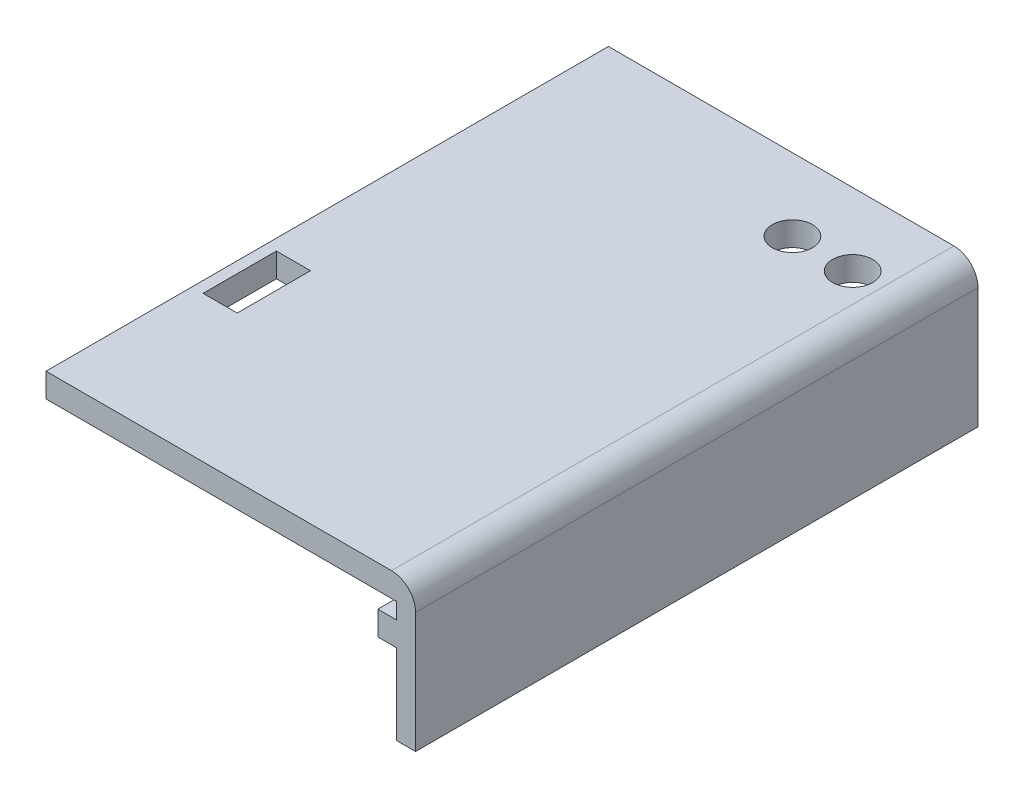
ISO-10303-21;
HEADER;
FILE_DESCRIPTION(('STEP AP214'),'2;1');
FILE_NAME('part.step','',(''),(''),'','','');
FILE_SCHEMA(('AUTOMOTIVE_DESIGN { 1 0 10303 214 1 1 1 1 }'));
ENDSEC;
DATA;
#1=APPLICATION_CONTEXT('core data for automotive mechanical design processes');
#2=APPLICATION_PROTOCOL_DEFINITION('international standard','automotive_design',2000,#1);
#3=PRODUCT_CONTEXT('',#1,'mechanical');
#4=PRODUCT('Part','Part','',(#3));
#5=PRODUCT_RELATED_PRODUCT_CATEGORY('part','',(#4));
#6=PRODUCT_DEFINITION_FORMATION('','',#4);
#7=PRODUCT_DEFINITION_CONTEXT('part definition',#1,'design');
#8=PRODUCT_DEFINITION('design','',#6,#7);
#9=PRODUCT_DEFINITION_SHAPE('','',#8);
#10=(LENGTH_UNIT() NAMED_UNIT(*) SI_UNIT(.MILLI.,.METRE.));
#11=(NAMED_UNIT(*) PLANE_ANGLE_UNIT() SI_UNIT($,.RADIAN.));
#12=(NAMED_UNIT(*) SI_UNIT($,.STERADIAN.) SOLID_ANGLE_UNIT());
#13=UNCERTAINTY_MEASURE_WITH_UNIT(LENGTH_MEASURE(1.E-05),#10,'distance_accuracy_value','');
#14=(GEOMETRIC_REPRESENTATION_CONTEXT(3) GLOBAL_UNCERTAINTY_ASSIGNED_CONTEXT((#13)) GLOBAL_UNIT_ASSIGNED_CONTEXT((#10,
#11,#12)) REPRESENTATION_CONTEXT('',''));
#15=CARTESIAN_POINT('',(0.,0.,0.));
#16=DIRECTION('',(0.,0.,1.));
#17=DIRECTION('',(1.,0.,0.));
#18=AXIS2_PLACEMENT_3D('',#15,#16,#17);
#19=CARTESIAN_POINT('',(-23.,6.,70.));
#20=DIRECTION('',(0.,1.,0.));
#21=DIRECTION('',(0.,0.,1.));
#22=AXIS2_PLACEMENT_3D('',#19,#20,#21);
#23=PLANE('',#22);
#24=DIRECTION('',(-1.,0.,0.));
#25=VECTOR('',#24,1.);
#26=CARTESIAN_POINT('',(-23.,6.,42.7111351247363));
#27=LINE('',#26,#25);
#28=CARTESIAN_POINT('',(-17.366045999883,6.,42.7111351247363));
#29=VERTEX_POINT('',#28);
#30=CARTESIAN_POINT('',(-21.6133546008317,6.,42.7111351247363));
#31=VERTEX_POINT('',#30);
#32=EDGE_CURVE('E264',#29,#31,#27,.T.);
#33=ORIENTED_EDGE('',*,*,#32,.T.);
#34=DIRECTION('',(0.,0.,1.));
#35=VECTOR('',#34,1.);
#36=CARTESIAN_POINT('',(-21.6133546008317,6.,70.));
#37=LINE('',#36,#35);
#38=CARTESIAN_POINT('',(-21.6133546008317,6.,51.836082990488));
#39=VERTEX_POINT('',#38);
#40=EDGE_CURVE('E267',#31,#39,#37,.T.);
#41=ORIENTED_EDGE('',*,*,#40,.T.);
#42=DIRECTION('',(1.,0.,0.));
#43=VECTOR('',#42,1.);
#44=CARTESIAN_POINT('',(-23.,6.,51.836082990488));
#45=LINE('',#44,#43);
#46=CARTESIAN_POINT('',(-17.366045999883,6.,51.836082990488));
#47=VERTEX_POINT('',#46);
#48=EDGE_CURVE('E259',#39,#47,#45,.T.);
#49=ORIENTED_EDGE('',*,*,#48,.T.);
#50=DIRECTION('',(0.,0.,-1.));
#51=VECTOR('',#50,1.);
#52=CARTESIAN_POINT('',(-17.366045999883,6.,70.));
#53=LINE('',#52,#51);
#54=EDGE_CURVE('E239',#47,#29,#53,.T.);
#55=ORIENTED_EDGE('',*,*,#54,.T.);
#56=EDGE_LOOP('',(#33,#41,#49,#55));
#57=FACE_BOUND('',#56,.T.);
#58=CARTESIAN_POINT('',(8.9,6.,9.));
#59=DIRECTION('',(0.,1.,0.));
#60=DIRECTION('',(0.,0.,1.));
#61=AXIS2_PLACEMENT_3D('',#58,#59,#60);
#62=CIRCLE('',#61,2.5);
#63=CARTESIAN_POINT('',(8.9,6.,11.5));
#64=VERTEX_POINT('',#63);
#65=EDGE_CURVE('E273',#64,#64,#62,.T.);
#66=ORIENTED_EDGE('',*,*,#65,.T.);
#67=EDGE_LOOP('',(#66));
#68=FACE_BOUND('',#67,.T.);
#69=CARTESIAN_POINT('',(16.4,6.,9.));
#70=DIRECTION('',(0.,1.,0.));
#71=DIRECTION('',(0.,0.,1.));
#72=AXIS2_PLACEMENT_3D('',#69,#70,#71);
#73=CIRCLE('',#72,2.5);
#74=CARTESIAN_POINT('',(16.4,6.,11.5));
#75=VERTEX_POINT('',#74);
#76=EDGE_CURVE('E279',#75,#75,#73,.T.);
#77=ORIENTED_EDGE('',*,*,#76,.T.);
#78=EDGE_LOOP('',(#77));
#79=FACE_BOUND('',#78,.T.);
#80=DIRECTION('',(0.,0.,1.));
#81=VECTOR('',#80,1.);
#82=CARTESIAN_POINT('',(-18.,6.,70.));
#83=LINE('',#82,#81);
#84=CARTESIAN_POINT('',(-18.,6.,61.3385621722339));
#85=VERTEX_POINT('',#84);
#86=CARTESIAN_POINT('',(-18.,6.,62.6614378277661));
#87=VERTEX_POINT('',#86);
#88=EDGE_CURVE('E479',#85,#87,#83,.T.);
#89=ORIENTED_EDGE('',*,*,#88,.F.);
#90=DIRECTION('',(-1.,0.,0.));
#91=VECTOR('',#90,1.);
#92=CARTESIAN_POINT('',(-18.,6.,61.3385621722339));
#93=LINE('',#92,#91);
#94=CARTESIAN_POINT('',(-19.,6.,61.3385621722339));
#95=VERTEX_POINT('',#94);
#96=EDGE_CURVE('E291',#85,#95,#93,.T.);
#97=ORIENTED_EDGE('',*,*,#96,.T.);
#98=DIRECTION('',(0.,0.,1.));
#99=VECTOR('',#98,1.);
#100=CARTESIAN_POINT('',(-19.,6.,64.5));
#101=LINE('',#100,#99);
#102=CARTESIAN_POINT('',(-19.,6.,59.5));
#103=VERTEX_POINT('',#102);
#104=EDGE_CURVE('E321',#103,#95,#101,.T.);
#105=ORIENTED_EDGE('',*,*,#104,.F.);
#106=DIRECTION('',(1.,0.,0.));
#107=VECTOR('',#106,1.);
#108=CARTESIAN_POINT('',(-23.,6.,59.5));
#109=LINE('',#108,#107);
#110=CARTESIAN_POINT('',(-23.,6.,59.5));
#111=VERTEX_POINT('',#110);
#112=EDGE_CURVE('E306',#111,#103,#109,.T.);
#113=ORIENTED_EDGE('',*,*,#112,.F.);
#114=DIRECTION('',(0.,0.,-1.));
#115=VECTOR('',#114,1.);
#116=CARTESIAN_POINT('',(-23.,6.,70.));
#117=LINE('',#116,#115);
#118=CARTESIAN_POINT('',(-23.,6.,10.5));
#119=VERTEX_POINT('',#118);
#120=EDGE_CURVE('E471',#111,#119,#117,.T.);
#121=ORIENTED_EDGE('',*,*,#120,.T.);
#122=DIRECTION('',(-1.,0.,0.));
#123=VECTOR('',#122,1.);
#124=CARTESIAN_POINT('',(-23.,6.,10.5));
#125=LINE('',#124,#123);
#126=CARTESIAN_POINT('',(-19.,6.,10.5));
#127=VERTEX_POINT('',#126);
#128=EDGE_CURVE('E342',#127,#119,#125,.T.);
#129=ORIENTED_EDGE('',*,*,#128,.F.);
#130=DIRECTION('',(0.,0.,1.));
#131=VECTOR('',#130,1.);
#132=CARTESIAN_POINT('',(-19.,6.,5.5));
#133=LINE('',#132,#131);
#134=CARTESIAN_POINT('',(-19.,6.,8.66143782776615));
#135=VERTEX_POINT('',#134);
#136=EDGE_CURVE('E351',#135,#127,#133,.T.);
#137=ORIENTED_EDGE('',*,*,#136,.F.);
#138=DIRECTION('',(-1.,0.,0.));
#139=VECTOR('',#138,1.);
#140=CARTESIAN_POINT('',(-18.,6.,8.66143782776615));
#141=LINE('',#140,#139);
#142=CARTESIAN_POINT('',(-18.,6.,8.66143782776615));
#143=VERTEX_POINT('',#142);
#144=EDGE_CURVE('E298',#135,#143,#141,.F.);
#145=ORIENTED_EDGE('',*,*,#144,.T.);
#146=DIRECTION('',(0.,0.,1.));
#147=VECTOR('',#146,1.);
#148=CARTESIAN_POINT('',(-18.,6.,70.));
#149=LINE('',#148,#147);
#150=CARTESIAN_POINT('',(-18.,6.,7.33856217223385));
#151=VERTEX_POINT('',#150);
#152=EDGE_CURVE('E474',#151,#143,#149,.T.);
#153=ORIENTED_EDGE('',*,*,#152,.F.);
#154=DIRECTION('',(-1.,0.,0.));
#155=VECTOR('',#154,1.);
#156=CARTESIAN_POINT('',(-18.,6.,7.33856217223385));
#157=LINE('',#156,#155);
#158=CARTESIAN_POINT('',(-19.,6.,7.33856217223385));
#159=VERTEX_POINT('',#158);
#160=EDGE_CURVE('E303',#151,#159,#157,.T.);
#161=ORIENTED_EDGE('',*,*,#160,.T.);
#162=CARTESIAN_POINT('',(-19.,6.,5.50000000000001));
#163=VERTEX_POINT('',#162);
#164=EDGE_CURVE('E352',#163,#159,#133,.T.);
#165=ORIENTED_EDGE('',*,*,#164,.F.);
#166=DIRECTION('',(1.,0.,0.));
#167=VECTOR('',#166,1.);
#168=CARTESIAN_POINT('',(-23.,6.,5.50000000000001));
#169=LINE('',#168,#167);
#170=CARTESIAN_POINT('',(-23.,6.,5.50000000000001));
#171=VERTEX_POINT('',#170);
#172=EDGE_CURVE('E337',#171,#163,#169,.T.);
#173=ORIENTED_EDGE('',*,*,#172,.F.);
#174=CARTESIAN_POINT('',(-23.,6.,0.));
#175=VERTEX_POINT('',#174);
#176=EDGE_CURVE('E467',#171,#175,#117,.T.);
#177=ORIENTED_EDGE('',*,*,#176,.T.);
#178=DIRECTION('',(1.,0.,0.));
#179=VECTOR('',#178,1.);
#180=CARTESIAN_POINT('',(-23.,6.,0.));
#181=LINE('',#180,#179);
#182=CARTESIAN_POINT('',(20.6,6.,0.));
#183=VERTEX_POINT('',#182);
#184=EDGE_CURVE('E445',#175,#183,#181,.T.);
#185=ORIENTED_EDGE('',*,*,#184,.T.);
#186=DIRECTION('',(0.,0.,-1.));
#187=VECTOR('',#186,1.);
#188=CARTESIAN_POINT('',(20.6,6.,70.));
#189=LINE('',#188,#187);
#190=CARTESIAN_POINT('',(20.6,6.,70.));
#191=VERTEX_POINT('',#190);
#192=EDGE_CURVE('E464',#191,#183,#189,.T.);
#193=ORIENTED_EDGE('',*,*,#192,.F.);
#194=DIRECTION('',(1.,0.,0.));
#195=VECTOR('',#194,1.);
#196=CARTESIAN_POINT('',(-23.,6.,70.));
#197=LINE('',#196,#195);
#198=CARTESIAN_POINT('',(-23.,6.,70.));
#199=VERTEX_POINT('',#198);
#200=EDGE_CURVE('E428',#199,#191,#197,.T.);
#201=ORIENTED_EDGE('',*,*,#200,.F.);
#202=CARTESIAN_POINT('',(-23.,6.,64.5));
#203=VERTEX_POINT('',#202);
#204=EDGE_CURVE('E468',#199,#203,#117,.T.);
#205=ORIENTED_EDGE('',*,*,#204,.T.);
#206=DIRECTION('',(-1.,0.,0.));
#207=VECTOR('',#206,1.);
#208=CARTESIAN_POINT('',(-23.,6.,64.5));
#209=LINE('',#208,#207);
#210=CARTESIAN_POINT('',(-19.,6.,64.5));
#211=VERTEX_POINT('',#210);
#212=EDGE_CURVE('E311',#211,#203,#209,.T.);
#213=ORIENTED_EDGE('',*,*,#212,.F.);
#214=CARTESIAN_POINT('',(-19.,6.,62.6614378277661));
#215=VERTEX_POINT('',#214);
#216=EDGE_CURVE('E320',#215,#211,#101,.T.);
#217=ORIENTED_EDGE('',*,*,#216,.F.);
#218=DIRECTION('',(-1.,0.,0.));
#219=VECTOR('',#218,1.);
#220=CARTESIAN_POINT('',(-18.,6.,62.6614378277661));
#221=LINE('',#220,#219);
#222=EDGE_CURVE('E286',#215,#87,#221,.F.);
#223=ORIENTED_EDGE('',*,*,#222,.T.);
#224=EDGE_LOOP('',(#89,#97,#105,#113,#121,#129,#137,#145,#153,#161,#165,#173,#177,#185,#193,
#201,#205,#213,#217,#223));
#225=FACE_BOUND('',#224,.T.);
#226=ADVANCED_FACE('F31',(#57,#68,#79,#225),#23,.F.);
#227=CARTESIAN_POINT('',(20.6,-9.,70.));
#228=DIRECTION('',(1.,0.,0.));
#229=DIRECTION('',(0.,0.,-1.));
#230=AXIS2_PLACEMENT_3D('',#227,#228,#229);
#231=PLANE('',#230);
#232=DIRECTION('',(0.,0.,-1.));
#233=VECTOR('',#232,1.);
#234=CARTESIAN_POINT('',(20.6,4.,70.));
#235=LINE('',#234,#233);
#236=CARTESIAN_POINT('',(20.6,4.,70.));
#237=VERTEX_POINT('',#236);
#238=CARTESIAN_POINT('',(20.6,4.,67.));
#239=VERTEX_POINT('',#238);
#240=EDGE_CURVE('E368',#237,#239,#235,.T.);
#241=ORIENTED_EDGE('',*,*,#240,.F.);
#242=DIRECTION('',(0.,-1.,0.));
#243=VECTOR('',#242,1.);
#244=CARTESIAN_POINT('',(20.6,-9.,70.));
#245=LINE('',#244,#243);
#246=EDGE_CURVE('E432',#191,#237,#245,.T.);
#247=ORIENTED_EDGE('',*,*,#246,.F.);
#248=ORIENTED_EDGE('',*,*,#192,.T.);
#249=DIRECTION('',(0.,-1.,0.));
#250=VECTOR('',#249,1.);
#251=CARTESIAN_POINT('',(20.6,-9.,0.));
#252=LINE('',#251,#250);
#253=CARTESIAN_POINT('',(20.6,4.,0.));
#254=VERTEX_POINT('',#253);
#255=EDGE_CURVE('E448',#183,#254,#252,.T.);
#256=ORIENTED_EDGE('',*,*,#255,.T.);
#257=DIRECTION('',(0.,0.,-1.));
#258=VECTOR('',#257,1.);
#259=CARTESIAN_POINT('',(20.6,4.,0.));
#260=LINE('',#259,#258);
#261=CARTESIAN_POINT('',(20.6,4.,3.));
#262=VERTEX_POINT('',#261);
#263=EDGE_CURVE('E399',#262,#254,#260,.T.);
#264=ORIENTED_EDGE('',*,*,#263,.F.);
#265=DIRECTION('',(0.,1.,0.));
#266=VECTOR('',#265,1.);
#267=CARTESIAN_POINT('',(20.6,1.,3.));
#268=LINE('',#267,#266);
#269=CARTESIAN_POINT('',(20.6,1.,3.));
#270=VERTEX_POINT('',#269);
#271=EDGE_CURVE('E408',#270,#262,#268,.T.);
#272=ORIENTED_EDGE('',*,*,#271,.F.);
#273=DIRECTION('',(0.,0.,1.));
#274=VECTOR('',#273,1.);
#275=CARTESIAN_POINT('',(20.6,1.,0.));
#276=LINE('',#275,#274);
#277=CARTESIAN_POINT('',(20.6,1.,0.));
#278=VERTEX_POINT('',#277);
#279=EDGE_CURVE('E394',#278,#270,#276,.T.);
#280=ORIENTED_EDGE('',*,*,#279,.F.);
#281=CARTESIAN_POINT('',(20.6,-9.,0.));
#282=VERTEX_POINT('',#281);
#283=EDGE_CURVE('E447',#278,#282,#252,.T.);
#284=ORIENTED_EDGE('',*,*,#283,.T.);
#285=DIRECTION('',(0.,0.,-1.));
#286=VECTOR('',#285,1.);
#287=CARTESIAN_POINT('',(20.6,-9.,70.));
#288=LINE('',#287,#286);
#289=CARTESIAN_POINT('',(20.6,-9.,70.));
#290=VERTEX_POINT('',#289);
#291=EDGE_CURVE('E461',#290,#282,#288,.T.);
#292=ORIENTED_EDGE('',*,*,#291,.F.);
#293=CARTESIAN_POINT('',(20.6,1.,70.));
#294=VERTEX_POINT('',#293);
#295=EDGE_CURVE('E431',#294,#290,#245,.T.);
#296=ORIENTED_EDGE('',*,*,#295,.F.);
#297=DIRECTION('',(0.,0.,1.));
#298=VECTOR('',#297,1.);
#299=CARTESIAN_POINT('',(20.6,1.,70.));
#300=LINE('',#299,#298);
#301=CARTESIAN_POINT('',(20.6,1.,67.));
#302=VERTEX_POINT('',#301);
#303=EDGE_CURVE('E373',#302,#294,#300,.T.);
#304=ORIENTED_EDGE('',*,*,#303,.F.);
#305=DIRECTION('',(0.,-1.,0.));
#306=VECTOR('',#305,1.);
#307=CARTESIAN_POINT('',(20.6,1.,67.));
#308=LINE('',#307,#306);
#309=EDGE_CURVE('E381',#239,#302,#308,.T.);
#310=ORIENTED_EDGE('',*,*,#309,.F.);
#311=EDGE_LOOP('',(#241,#247,#248,#256,#264,#272,#280,#284,#292,#296,#304,#310));
#312=FACE_BOUND('',#311,.T.);
#313=ADVANCED_FACE('F519',(#312),#231,.F.);
#314=CARTESIAN_POINT('',(-23.,9.,70.));
#315=DIRECTION('',(1.,0.,0.));
#316=DIRECTION('',(0.,0.,-1.));
#317=AXIS2_PLACEMENT_3D('',#314,#315,#316);
#318=PLANE('',#317);
#319=CARTESIAN_POINT('',(-23.,6.75,62.));
#320=DIRECTION('',(-1.,0.,0.));
#321=DIRECTION('',(0.,0.,1.));
#322=AXIS2_PLACEMENT_3D('',#319,#320,#321);
#323=CIRCLE('',#322,0.999999999999991);
#324=CARTESIAN_POINT('',(-23.,6.75,63.));
#325=VERTEX_POINT('',#324);
#326=EDGE_CURVE('E282',#325,#325,#323,.T.);
#327=ORIENTED_EDGE('',*,*,#326,.F.);
#328=EDGE_LOOP('',(#327));
#329=FACE_BOUND('',#328,.T.);
#330=CARTESIAN_POINT('',(-23.,6.75,8.));
#331=DIRECTION('',(-1.,0.,0.));
#332=DIRECTION('',(0.,0.,1.));
#333=AXIS2_PLACEMENT_3D('',#330,#331,#332);
#334=CIRCLE('',#333,1.);
#335=CARTESIAN_POINT('',(-23.,6.75,9.));
#336=VERTEX_POINT('',#335);
#337=EDGE_CURVE('E294',#336,#336,#334,.T.);
#338=ORIENTED_EDGE('',*,*,#337,.F.);
#339=EDGE_LOOP('',(#338));
#340=FACE_BOUND('',#339,.T.);
#341=DIRECTION('',(0.,-1.,0.));
#342=VECTOR('',#341,1.);
#343=CARTESIAN_POINT('',(-23.,9.,0.));
#344=LINE('',#343,#342);
#345=CARTESIAN_POINT('',(-23.,9.,0.));
#346=VERTEX_POINT('',#345);
#347=EDGE_CURVE('E424',#346,#175,#344,.T.);
#348=ORIENTED_EDGE('',*,*,#347,.T.);
#349=ORIENTED_EDGE('',*,*,#176,.F.);
#350=DIRECTION('',(0.,1.,0.));
#351=VECTOR('',#350,1.);
#352=CARTESIAN_POINT('',(-23.,4.,5.50000000000001));
#353=LINE('',#352,#351);
#354=CARTESIAN_POINT('',(-23.,4.,5.50000000000001));
#355=VERTEX_POINT('',#354);
#356=EDGE_CURVE('E365',#355,#171,#353,.T.);
#357=ORIENTED_EDGE('',*,*,#356,.F.);
#358=DIRECTION('',(0.,0.,-1.));
#359=VECTOR('',#358,1.);
#360=CARTESIAN_POINT('',(-23.,4.,5.50000000000001));
#361=LINE('',#360,#359);
#362=CARTESIAN_POINT('',(-23.,4.,10.5));
#363=VERTEX_POINT('',#362);
#364=EDGE_CURVE('E338',#363,#355,#361,.T.);
#365=ORIENTED_EDGE('',*,*,#364,.F.);
#366=DIRECTION('',(0.,1.,0.));
#367=VECTOR('',#366,1.);
#368=CARTESIAN_POINT('',(-23.,4.,10.5));
#369=LINE('',#368,#367);
#370=EDGE_CURVE('E348',#363,#119,#369,.T.);
#371=ORIENTED_EDGE('',*,*,#370,.T.);
#372=ORIENTED_EDGE('',*,*,#120,.F.);
#373=DIRECTION('',(0.,1.,0.));
#374=VECTOR('',#373,1.);
#375=CARTESIAN_POINT('',(-23.,4.,59.5));
#376=LINE('',#375,#374);
#377=CARTESIAN_POINT('',(-23.,4.,59.5));
#378=VERTEX_POINT('',#377);
#379=EDGE_CURVE('E334',#378,#111,#376,.T.);
#380=ORIENTED_EDGE('',*,*,#379,.F.);
#381=DIRECTION('',(0.,0.,-1.));
#382=VECTOR('',#381,1.);
#383=CARTESIAN_POINT('',(-23.,4.,64.5));
#384=LINE('',#383,#382);
#385=CARTESIAN_POINT('',(-23.,4.,64.5));
#386=VERTEX_POINT('',#385);
#387=EDGE_CURVE('E307',#386,#378,#384,.T.);
#388=ORIENTED_EDGE('',*,*,#387,.F.);
#389=DIRECTION('',(0.,1.,0.));
#390=VECTOR('',#389,1.);
#391=CARTESIAN_POINT('',(-23.,4.,64.5));
#392=LINE('',#391,#390);
#393=EDGE_CURVE('E317',#386,#203,#392,.T.);
#394=ORIENTED_EDGE('',*,*,#393,.T.);
#395=ORIENTED_EDGE('',*,*,#204,.F.);
#396=DIRECTION('',(0.,-1.,0.));
#397=VECTOR('',#396,1.);
#398=CARTESIAN_POINT('',(-23.,9.,70.));
#399=LINE('',#398,#397);
#400=CARTESIAN_POINT('',(-23.,9.,70.));
#401=VERTEX_POINT('',#400);
#402=EDGE_CURVE('E425',#401,#199,#399,.T.);
#403=ORIENTED_EDGE('',*,*,#402,.F.);
#404=DIRECTION('',(0.,0.,-1.));
#405=VECTOR('',#404,1.);
#406=CARTESIAN_POINT('',(-23.,9.,70.));
#407=LINE('',#406,#405);
#408=EDGE_CURVE('E442',#401,#346,#407,.T.);
#409=ORIENTED_EDGE('',*,*,#408,.T.);
#410=EDGE_LOOP('',(#348,#349,#357,#365,#371,#372,#380,#388,#394,#395,#403,#409));
#411=FACE_BOUND('',#410,.T.);
#412=ADVANCED_FACE('F508',(#329,#340,#411),#318,.F.);
#413=CARTESIAN_POINT('',(23.,-9.,70.));
#414=DIRECTION('',(0.,1.,0.));
#415=DIRECTION('',(-1.,0.,0.));
#416=AXIS2_PLACEMENT_3D('',#413,#414,#415);
#417=PLANE('',#416);
#418=DIRECTION('',(1.,0.,0.));
#419=VECTOR('',#418,1.);
#420=CARTESIAN_POINT('',(23.,-9.,0.));
#421=LINE('',#420,#419);
#422=CARTESIAN_POINT('',(23.,-9.,0.));
#423=VERTEX_POINT('',#422);
#424=EDGE_CURVE('E450',#282,#423,#421,.T.);
#425=ORIENTED_EDGE('',*,*,#424,.T.);
#426=DIRECTION('',(0.,0.,-1.));
#427=VECTOR('',#426,1.);
#428=CARTESIAN_POINT('',(23.,-9.,70.));
#429=LINE('',#428,#427);
#430=CARTESIAN_POINT('',(23.,-9.,70.));
#431=VERTEX_POINT('',#430);
#432=EDGE_CURVE('E458',#431,#423,#429,.T.);
#433=ORIENTED_EDGE('',*,*,#432,.F.);
#434=DIRECTION('',(1.,0.,0.));
#435=VECTOR('',#434,1.);
#436=CARTESIAN_POINT('',(23.,-9.,70.));
#437=LINE('',#436,#435);
#438=EDGE_CURVE('E435',#290,#431,#437,.T.);
#439=ORIENTED_EDGE('',*,*,#438,.F.);
#440=ORIENTED_EDGE('',*,*,#291,.T.);
#441=EDGE_LOOP('',(#425,#433,#439,#440));
#442=FACE_BOUND('',#441,.T.);
#443=ADVANCED_FACE('F541',(#442),#417,.F.);
#444=CARTESIAN_POINT('',(23.,-9.,70.));
#445=DIRECTION('',(-1.,0.,0.));
#446=DIRECTION('',(0.,0.,1.));
#447=AXIS2_PLACEMENT_3D('',#444,#445,#446);
#448=PLANE('',#447);
#449=DIRECTION('',(0.,1.,0.));
#450=VECTOR('',#449,1.);
#451=CARTESIAN_POINT('',(23.,-9.,0.));
#452=LINE('',#451,#450);
#453=CARTESIAN_POINT('',(23.,6.,0.));
#454=VERTEX_POINT('',#453);
#455=EDGE_CURVE('E452',#423,#454,#452,.T.);
#456=ORIENTED_EDGE('',*,*,#455,.T.);
#457=DIRECTION('',(0.,0.,-1.));
#458=VECTOR('',#457,1.);
#459=CARTESIAN_POINT('',(23.,6.,70.));
#460=LINE('',#459,#458);
#461=CARTESIAN_POINT('',(23.,6.,70.));
#462=VERTEX_POINT('',#461);
#463=EDGE_CURVE('E39',#454,#462,#460,.F.);
#464=ORIENTED_EDGE('',*,*,#463,.T.);
#465=DIRECTION('',(0.,1.,0.));
#466=VECTOR('',#465,1.);
#467=CARTESIAN_POINT('',(23.,-9.,70.));
#468=LINE('',#467,#466);
#469=EDGE_CURVE('E437',#431,#462,#468,.T.);
#470=ORIENTED_EDGE('',*,*,#469,.F.);
#471=ORIENTED_EDGE('',*,*,#432,.T.);
#472=EDGE_LOOP('',(#456,#464,#470,#471));
#473=FACE_BOUND('',#472,.T.);
#474=ADVANCED_FACE('F488',(#473),#448,.F.);
#475=CARTESIAN_POINT('',(-23.,9.,70.));
#476=DIRECTION('',(0.,-1.,0.));
#477=DIRECTION('',(0.,0.,-1.));
#478=AXIS2_PLACEMENT_3D('',#475,#476,#477);
#479=PLANE('',#478);
#480=DIRECTION('',(1.,0.,0.));
#481=VECTOR('',#480,1.);
#482=CARTESIAN_POINT('',(-21.6133546008317,9.,51.836082990488));
#483=LINE('',#482,#481);
#484=CARTESIAN_POINT('',(-21.6133546008317,9.,51.836082990488));
#485=VERTEX_POINT('',#484);
#486=CARTESIAN_POINT('',(-17.366045999883,9.,51.836082990488));
#487=VERTEX_POINT('',#486);
#488=EDGE_CURVE('E245',#485,#487,#483,.T.);
#489=ORIENTED_EDGE('',*,*,#488,.F.);
#490=DIRECTION('',(0.,0.,1.));
#491=VECTOR('',#490,1.);
#492=CARTESIAN_POINT('',(-21.6133546008317,9.,42.7111351247363));
#493=LINE('',#492,#491);
#494=CARTESIAN_POINT('',(-21.6133546008317,9.,42.7111351247363));
#495=VERTEX_POINT('',#494);
#496=EDGE_CURVE('E54',#495,#485,#493,.T.);
#497=ORIENTED_EDGE('',*,*,#496,.F.);
#498=DIRECTION('',(-1.,0.,0.));
#499=VECTOR('',#498,1.);
#500=CARTESIAN_POINT('',(-21.6133546008317,9.,42.7111351247363));
#501=LINE('',#500,#499);
#502=CARTESIAN_POINT('',(-17.366045999883,9.,42.7111351247363));
#503=VERTEX_POINT('',#502);
#504=EDGE_CURVE('E252',#503,#495,#501,.T.);
#505=ORIENTED_EDGE('',*,*,#504,.F.);
#506=DIRECTION('',(0.,0.,-1.));
#507=VECTOR('',#506,1.);
#508=CARTESIAN_POINT('',(-17.366045999883,9.,42.7111351247363));
#509=LINE('',#508,#507);
#510=EDGE_CURVE('E236',#487,#503,#509,.T.);
#511=ORIENTED_EDGE('',*,*,#510,.F.);
#512=EDGE_LOOP('',(#489,#497,#505,#511));
#513=FACE_BOUND('',#512,.T.);
#514=CARTESIAN_POINT('',(8.9,9.,9.));
#515=DIRECTION('',(0.,1.,0.));
#516=DIRECTION('',(0.,0.,1.));
#517=AXIS2_PLACEMENT_3D('',#514,#515,#516);
#518=CIRCLE('',#517,2.5);
#519=CARTESIAN_POINT('',(8.9,9.,11.5));
#520=VERTEX_POINT('',#519);
#521=EDGE_CURVE('E270',#520,#520,#518,.T.);
#522=ORIENTED_EDGE('',*,*,#521,.F.);
#523=EDGE_LOOP('',(#522));
#524=FACE_BOUND('',#523,.T.);
#525=CARTESIAN_POINT('',(16.4,9.,9.));
#526=DIRECTION('',(0.,1.,0.));
#527=DIRECTION('',(0.,0.,1.));
#528=AXIS2_PLACEMENT_3D('',#525,#526,#527);
#529=CIRCLE('',#528,2.5);
#530=CARTESIAN_POINT('',(16.4,9.,11.5));
#531=VERTEX_POINT('',#530);
#532=EDGE_CURVE('E276',#531,#531,#529,.T.);
#533=ORIENTED_EDGE('',*,*,#532,.F.);
#534=EDGE_LOOP('',(#533));
#535=FACE_BOUND('',#534,.T.);
#536=DIRECTION('',(-1.,0.,0.));
#537=VECTOR('',#536,1.);
#538=CARTESIAN_POINT('',(-23.,9.,70.));
#539=LINE('',#538,#537);
#540=CARTESIAN_POINT('',(20.,9.,70.));
#541=VERTEX_POINT('',#540);
#542=EDGE_CURVE('E440',#541,#401,#539,.T.);
#543=ORIENTED_EDGE('',*,*,#542,.F.);
#544=DIRECTION('',(0.,0.,-1.));
#545=VECTOR('',#544,1.);
#546=CARTESIAN_POINT('',(20.,9.,70.));
#547=LINE('',#546,#545);
#548=CARTESIAN_POINT('',(20.,9.,0.));
#549=VERTEX_POINT('',#548);
#550=EDGE_CURVE('E481',#541,#549,#547,.T.);
#551=ORIENTED_EDGE('',*,*,#550,.T.);
#552=DIRECTION('',(-1.,0.,0.));
#553=VECTOR('',#552,1.);
#554=CARTESIAN_POINT('',(-23.,9.,0.));
#555=LINE('',#554,#553);
#556=EDGE_CURVE('E429',#549,#346,#555,.T.);
#557=ORIENTED_EDGE('',*,*,#556,.T.);
#558=ORIENTED_EDGE('',*,*,#408,.F.);
#559=EDGE_LOOP('',(#543,#551,#557,#558));
#560=FACE_BOUND('',#559,.T.);
#561=ADVANCED_FACE('F249',(#513,#524,#535,#560),#479,.F.);
#562=CARTESIAN_POINT('',(-23.,6.,70.));
#563=DIRECTION('',(0.,0.,1.));
#564=DIRECTION('',(1.,0.,0.));
#565=AXIS2_PLACEMENT_3D('',#562,#563,#564);
#566=PLANE('',#565);
#567=ORIENTED_EDGE('',*,*,#469,.T.);
#568=CARTESIAN_POINT('',(20.,6.,70.));
#569=DIRECTION('',(0.,0.,1.));
#570=DIRECTION('',(1.,0.,0.));
#571=AXIS2_PLACEMENT_3D('',#568,#569,#570);
#572=CIRCLE('',#571,3.);
#573=EDGE_CURVE('E11',#462,#541,#572,.T.);
#574=ORIENTED_EDGE('',*,*,#573,.T.);
#575=ORIENTED_EDGE('',*,*,#542,.T.);
#576=ORIENTED_EDGE('',*,*,#402,.T.);
#577=ORIENTED_EDGE('',*,*,#200,.T.);
#578=ORIENTED_EDGE('',*,*,#246,.T.);
#579=DIRECTION('',(1.,0.,0.));
#580=VECTOR('',#579,1.);
#581=CARTESIAN_POINT('',(18.3,4.,70.));
#582=LINE('',#581,#580);
#583=CARTESIAN_POINT('',(18.3,4.,70.));
#584=VERTEX_POINT('',#583);
#585=EDGE_CURVE('E392',#584,#237,#582,.T.);
#586=ORIENTED_EDGE('',*,*,#585,.F.);
#587=DIRECTION('',(0.,1.,0.));
#588=VECTOR('',#587,1.);
#589=CARTESIAN_POINT('',(18.3,1.,70.));
#590=LINE('',#589,#588);
#591=CARTESIAN_POINT('',(18.3,1.,70.));
#592=VERTEX_POINT('',#591);
#593=EDGE_CURVE('E369',#592,#584,#590,.T.);
#594=ORIENTED_EDGE('',*,*,#593,.F.);
#595=DIRECTION('',(1.,0.,0.));
#596=VECTOR('',#595,1.);
#597=CARTESIAN_POINT('',(18.3,1.,70.));
#598=LINE('',#597,#596);
#599=EDGE_CURVE('E379',#592,#294,#598,.T.);
#600=ORIENTED_EDGE('',*,*,#599,.T.);
#601=ORIENTED_EDGE('',*,*,#295,.T.);
#602=ORIENTED_EDGE('',*,*,#438,.T.);
#603=EDGE_LOOP('',(#567,#574,#575,#576,#577,#578,#586,#594,#600,#601,#602));
#604=FACE_BOUND('',#603,.T.);
#605=ADVANCED_FACE('F493',(#604),#566,.T.);
#606=CARTESIAN_POINT('',(-23.,6.,0.));
#607=DIRECTION('',(0.,0.,1.));
#608=DIRECTION('',(1.,0.,0.));
#609=AXIS2_PLACEMENT_3D('',#606,#607,#608);
#610=PLANE('',#609);
#611=ORIENTED_EDGE('',*,*,#556,.F.);
#612=CARTESIAN_POINT('',(20.,6.,0.));
#613=DIRECTION('',(0.,0.,1.));
#614=DIRECTION('',(1.,0.,0.));
#615=AXIS2_PLACEMENT_3D('',#612,#613,#614);
#616=CIRCLE('',#615,3.);
#617=EDGE_CURVE('E484',#549,#454,#616,.F.);
#618=ORIENTED_EDGE('',*,*,#617,.T.);
#619=ORIENTED_EDGE('',*,*,#455,.F.);
#620=ORIENTED_EDGE('',*,*,#424,.F.);
#621=ORIENTED_EDGE('',*,*,#283,.F.);
#622=DIRECTION('',(1.,0.,0.));
#623=VECTOR('',#622,1.);
#624=CARTESIAN_POINT('',(18.3,1.,0.));
#625=LINE('',#624,#623);
#626=CARTESIAN_POINT('',(18.3,1.,0.));
#627=VERTEX_POINT('',#626);
#628=EDGE_CURVE('E421',#627,#278,#625,.T.);
#629=ORIENTED_EDGE('',*,*,#628,.F.);
#630=DIRECTION('',(0.,-1.,0.));
#631=VECTOR('',#630,1.);
#632=CARTESIAN_POINT('',(18.3,1.,0.));
#633=LINE('',#632,#631);
#634=CARTESIAN_POINT('',(18.3,4.,0.));
#635=VERTEX_POINT('',#634);
#636=EDGE_CURVE('E395',#635,#627,#633,.T.);
#637=ORIENTED_EDGE('',*,*,#636,.F.);
#638=DIRECTION('',(1.,0.,0.));
#639=VECTOR('',#638,1.);
#640=CARTESIAN_POINT('',(18.3,4.,0.));
#641=LINE('',#640,#639);
#642=EDGE_CURVE('E405',#635,#254,#641,.T.);
#643=ORIENTED_EDGE('',*,*,#642,.T.);
#644=ORIENTED_EDGE('',*,*,#255,.F.);
#645=ORIENTED_EDGE('',*,*,#184,.F.);
#646=ORIENTED_EDGE('',*,*,#347,.F.);
#647=EDGE_LOOP('',(#611,#618,#619,#620,#621,#629,#637,#643,#644,#645,#646));
#648=FACE_BOUND('',#647,.T.);
#649=ADVANCED_FACE('F503',(#648),#610,.F.);
#650=CARTESIAN_POINT('',(18.3,1.,0.));
#651=DIRECTION('',(0.,1.,0.));
#652=DIRECTION('',(-1.,0.,0.));
#653=AXIS2_PLACEMENT_3D('',#650,#651,#652);
#654=PLANE('',#653);
#655=ORIENTED_EDGE('',*,*,#279,.T.);
#656=DIRECTION('',(1.,0.,0.));
#657=VECTOR('',#656,1.);
#658=CARTESIAN_POINT('',(18.3,1.,3.));
#659=LINE('',#658,#657);
#660=CARTESIAN_POINT('',(18.3,1.,3.));
#661=VERTEX_POINT('',#660);
#662=EDGE_CURVE('E418',#661,#270,#659,.T.);
#663=ORIENTED_EDGE('',*,*,#662,.F.);
#664=DIRECTION('',(0.,0.,1.));
#665=VECTOR('',#664,1.);
#666=CARTESIAN_POINT('',(18.3,1.,0.));
#667=LINE('',#666,#665);
#668=EDGE_CURVE('E398',#627,#661,#667,.T.);
#669=ORIENTED_EDGE('',*,*,#668,.F.);
#670=ORIENTED_EDGE('',*,*,#628,.T.);
#671=EDGE_LOOP('',(#655,#663,#669,#670));
#672=FACE_BOUND('',#671,.T.);
#673=ADVANCED_FACE('F546',(#672),#654,.F.);
#674=CARTESIAN_POINT('',(18.3,1.,3.));
#675=DIRECTION('',(0.,0.,-1.));
#676=DIRECTION('',(-1.,0.,0.));
#677=AXIS2_PLACEMENT_3D('',#674,#675,#676);
#678=PLANE('',#677);
#679=ORIENTED_EDGE('',*,*,#271,.T.);
#680=DIRECTION('',(1.,0.,0.));
#681=VECTOR('',#680,1.);
#682=CARTESIAN_POINT('',(18.3,4.,3.));
#683=LINE('',#682,#681);
#684=CARTESIAN_POINT('',(18.3,4.,3.));
#685=VERTEX_POINT('',#684);
#686=EDGE_CURVE('E415',#685,#262,#683,.T.);
#687=ORIENTED_EDGE('',*,*,#686,.F.);
#688=DIRECTION('',(0.,1.,0.));
#689=VECTOR('',#688,1.);
#690=CARTESIAN_POINT('',(18.3,1.,3.));
#691=LINE('',#690,#689);
#692=EDGE_CURVE('E401',#661,#685,#691,.T.);
#693=ORIENTED_EDGE('',*,*,#692,.F.);
#694=ORIENTED_EDGE('',*,*,#662,.T.);
#695=EDGE_LOOP('',(#679,#687,#693,#694));
#696=FACE_BOUND('',#695,.T.);
#697=ADVANCED_FACE('F556',(#696),#678,.F.);
#698=CARTESIAN_POINT('',(18.3,4.,0.));
#699=DIRECTION('',(0.,-1.,0.));
#700=DIRECTION('',(0.,0.,-1.));
#701=AXIS2_PLACEMENT_3D('',#698,#699,#700);
#702=PLANE('',#701);
#703=ORIENTED_EDGE('',*,*,#263,.T.);
#704=ORIENTED_EDGE('',*,*,#642,.F.);
#705=DIRECTION('',(0.,0.,-1.));
#706=VECTOR('',#705,1.);
#707=CARTESIAN_POINT('',(18.3,4.,0.));
#708=LINE('',#707,#706);
#709=EDGE_CURVE('E403',#685,#635,#708,.T.);
#710=ORIENTED_EDGE('',*,*,#709,.F.);
#711=ORIENTED_EDGE('',*,*,#686,.T.);
#712=EDGE_LOOP('',(#703,#704,#710,#711));
#713=FACE_BOUND('',#712,.T.);
#714=ADVANCED_FACE('F553',(#713),#702,.F.);
#715=CARTESIAN_POINT('',(18.3,4.,0.));
#716=DIRECTION('',(1.,0.,0.));
#717=DIRECTION('',(0.,0.,-1.));
#718=AXIS2_PLACEMENT_3D('',#715,#716,#717);
#719=PLANE('',#718);
#720=ORIENTED_EDGE('',*,*,#636,.T.);
#721=ORIENTED_EDGE('',*,*,#668,.T.);
#722=ORIENTED_EDGE('',*,*,#692,.T.);
#723=ORIENTED_EDGE('',*,*,#709,.T.);
#724=EDGE_LOOP('',(#720,#721,#722,#723));
#725=FACE_BOUND('',#724,.T.);
#726=ADVANCED_FACE('F549',(#725),#719,.F.);
#727=CARTESIAN_POINT('',(18.3,4.,70.));
#728=DIRECTION('',(0.,-1.,0.));
#729=DIRECTION('',(1.,0.,0.));
#730=AXIS2_PLACEMENT_3D('',#727,#728,#729);
#731=PLANE('',#730);
#732=ORIENTED_EDGE('',*,*,#240,.T.);
#733=DIRECTION('',(1.,0.,0.));
#734=VECTOR('',#733,1.);
#735=CARTESIAN_POINT('',(18.3,4.,67.));
#736=LINE('',#735,#734);
#737=CARTESIAN_POINT('',(18.3,4.,67.));
#738=VERTEX_POINT('',#737);
#739=EDGE_CURVE('E389',#738,#239,#736,.T.);
#740=ORIENTED_EDGE('',*,*,#739,.F.);
#741=DIRECTION('',(0.,0.,-1.));
#742=VECTOR('',#741,1.);
#743=CARTESIAN_POINT('',(18.3,4.,70.));
#744=LINE('',#743,#742);
#745=EDGE_CURVE('E372',#584,#738,#744,.T.);
#746=ORIENTED_EDGE('',*,*,#745,.F.);
#747=ORIENTED_EDGE('',*,*,#585,.T.);
#748=EDGE_LOOP('',(#732,#740,#746,#747));
#749=FACE_BOUND('',#748,.T.);
#750=ADVANCED_FACE('F524',(#749),#731,.F.);
#751=CARTESIAN_POINT('',(18.3,1.,67.));
#752=DIRECTION('',(0.,0.,1.));
#753=DIRECTION('',(1.,0.,0.));
#754=AXIS2_PLACEMENT_3D('',#751,#752,#753);
#755=PLANE('',#754);
#756=ORIENTED_EDGE('',*,*,#309,.T.);
#757=DIRECTION('',(1.,0.,0.));
#758=VECTOR('',#757,1.);
#759=CARTESIAN_POINT('',(18.3,1.,67.));
#760=LINE('',#759,#758);
#761=CARTESIAN_POINT('',(18.3,1.,67.));
#762=VERTEX_POINT('',#761);
#763=EDGE_CURVE('E386',#762,#302,#760,.T.);
#764=ORIENTED_EDGE('',*,*,#763,.F.);
#765=DIRECTION('',(0.,-1.,0.));
#766=VECTOR('',#765,1.);
#767=CARTESIAN_POINT('',(18.3,1.,67.));
#768=LINE('',#767,#766);
#769=EDGE_CURVE('E375',#738,#762,#768,.T.);
#770=ORIENTED_EDGE('',*,*,#769,.F.);
#771=ORIENTED_EDGE('',*,*,#739,.T.);
#772=EDGE_LOOP('',(#756,#764,#770,#771));
#773=FACE_BOUND('',#772,.T.);
#774=ADVANCED_FACE('F527',(#773),#755,.F.);
#775=CARTESIAN_POINT('',(18.3,1.,70.));
#776=DIRECTION('',(0.,1.,0.));
#777=DIRECTION('',(-1.,0.,0.));
#778=AXIS2_PLACEMENT_3D('',#775,#776,#777);
#779=PLANE('',#778);
#780=ORIENTED_EDGE('',*,*,#303,.T.);
#781=ORIENTED_EDGE('',*,*,#599,.F.);
#782=DIRECTION('',(0.,0.,1.));
#783=VECTOR('',#782,1.);
#784=CARTESIAN_POINT('',(18.3,1.,70.));
#785=LINE('',#784,#783);
#786=EDGE_CURVE('E377',#762,#592,#785,.T.);
#787=ORIENTED_EDGE('',*,*,#786,.F.);
#788=ORIENTED_EDGE('',*,*,#763,.T.);
#789=EDGE_LOOP('',(#780,#781,#787,#788));
#790=FACE_BOUND('',#789,.T.);
#791=ADVANCED_FACE('F537',(#790),#779,.F.);
#792=CARTESIAN_POINT('',(18.3,4.,70.));
#793=DIRECTION('',(-1.,0.,0.));
#794=DIRECTION('',(0.,0.,1.));
#795=AXIS2_PLACEMENT_3D('',#792,#793,#794);
#796=PLANE('',#795);
#797=ORIENTED_EDGE('',*,*,#593,.T.);
#798=ORIENTED_EDGE('',*,*,#745,.T.);
#799=ORIENTED_EDGE('',*,*,#769,.T.);
#800=ORIENTED_EDGE('',*,*,#786,.T.);
#801=EDGE_LOOP('',(#797,#798,#799,#800));
#802=FACE_BOUND('',#801,.T.);
#803=ADVANCED_FACE('F531',(#802),#796,.T.);
#804=CARTESIAN_POINT('',(-23.,4.,5.50000000000001));
#805=DIRECTION('',(0.,0.,1.));
#806=DIRECTION('',(1.,0.,0.));
#807=AXIS2_PLACEMENT_3D('',#804,#805,#806);
#808=PLANE('',#807);
#809=ORIENTED_EDGE('',*,*,#172,.T.);
#810=DIRECTION('',(0.,1.,0.));
#811=VECTOR('',#810,1.);
#812=CARTESIAN_POINT('',(-19.,4.,5.5));
#813=LINE('',#812,#811);
#814=CARTESIAN_POINT('',(-19.,4.,5.5));
#815=VERTEX_POINT('',#814);
#816=EDGE_CURVE('E362',#815,#163,#813,.T.);
#817=ORIENTED_EDGE('',*,*,#816,.F.);
#818=DIRECTION('',(1.,0.,0.));
#819=VECTOR('',#818,1.);
#820=CARTESIAN_POINT('',(-23.,4.,5.50000000000001));
#821=LINE('',#820,#819);
#822=EDGE_CURVE('E341',#355,#815,#821,.T.);
#823=ORIENTED_EDGE('',*,*,#822,.F.);
#824=ORIENTED_EDGE('',*,*,#356,.T.);
#825=EDGE_LOOP('',(#809,#817,#823,#824));
#826=FACE_BOUND('',#825,.T.);
#827=ADVANCED_FACE('F601',(#826),#808,.F.);
#828=CARTESIAN_POINT('',(-19.,4.,5.5));
#829=DIRECTION('',(-1.,0.,0.));
#830=DIRECTION('',(0.,0.,1.));
#831=AXIS2_PLACEMENT_3D('',#828,#829,#830);
#832=PLANE('',#831);
#833=ORIENTED_EDGE('',*,*,#164,.T.);
#834=CARTESIAN_POINT('',(-19.,6.75,8.));
#835=DIRECTION('',(-1.,0.,0.));
#836=DIRECTION('',(0.,0.,1.));
#837=AXIS2_PLACEMENT_3D('',#834,#835,#836);
#838=CIRCLE('',#837,1.);
#839=EDGE_CURVE('E470',#159,#135,#838,.T.);
#840=ORIENTED_EDGE('',*,*,#839,.T.);
#841=ORIENTED_EDGE('',*,*,#136,.T.);
#842=DIRECTION('',(0.,1.,0.));
#843=VECTOR('',#842,1.);
#844=CARTESIAN_POINT('',(-19.,4.,10.5));
#845=LINE('',#844,#843);
#846=CARTESIAN_POINT('',(-19.,4.,10.5));
#847=VERTEX_POINT('',#846);
#848=EDGE_CURVE('E359',#847,#127,#845,.T.);
#849=ORIENTED_EDGE('',*,*,#848,.F.);
#850=DIRECTION('',(0.,0.,1.));
#851=VECTOR('',#850,1.);
#852=CARTESIAN_POINT('',(-19.,4.,5.5));
#853=LINE('',#852,#851);
#854=EDGE_CURVE('E344',#815,#847,#853,.T.);
#855=ORIENTED_EDGE('',*,*,#854,.F.);
#856=ORIENTED_EDGE('',*,*,#816,.T.);
#857=EDGE_LOOP('',(#833,#840,#841,#849,#855,#856));
#858=FACE_BOUND('',#857,.T.);
#859=ADVANCED_FACE('F596',(#858),#832,.F.);
#860=CARTESIAN_POINT('',(-23.,4.,10.5));
#861=DIRECTION('',(0.,0.,-1.));
#862=DIRECTION('',(-1.,0.,0.));
#863=AXIS2_PLACEMENT_3D('',#860,#861,#862);
#864=PLANE('',#863);
#865=ORIENTED_EDGE('',*,*,#128,.T.);
#866=ORIENTED_EDGE('',*,*,#370,.F.);
#867=DIRECTION('',(-1.,0.,0.));
#868=VECTOR('',#867,1.);
#869=CARTESIAN_POINT('',(-23.,4.,10.5));
#870=LINE('',#869,#868);
#871=EDGE_CURVE('E346',#847,#363,#870,.T.);
#872=ORIENTED_EDGE('',*,*,#871,.F.);
#873=ORIENTED_EDGE('',*,*,#848,.T.);
#874=EDGE_LOOP('',(#865,#866,#872,#873));
#875=FACE_BOUND('',#874,.T.);
#876=ADVANCED_FACE('F609',(#875),#864,.F.);
#877=CARTESIAN_POINT('',(-23.,4.,10.5));
#878=DIRECTION('',(0.,1.,0.));
#879=DIRECTION('',(0.,0.,1.));
#880=AXIS2_PLACEMENT_3D('',#877,#878,#879);
#881=PLANE('',#880);
#882=ORIENTED_EDGE('',*,*,#364,.T.);
#883=ORIENTED_EDGE('',*,*,#822,.T.);
#884=ORIENTED_EDGE('',*,*,#854,.T.);
#885=ORIENTED_EDGE('',*,*,#871,.T.);
#886=EDGE_LOOP('',(#882,#883,#884,#885));
#887=FACE_BOUND('',#886,.T.);
#888=ADVANCED_FACE('F603',(#887),#881,.F.);
#889=CARTESIAN_POINT('',(-23.,4.,59.5));
#890=DIRECTION('',(0.,0.,1.));
#891=DIRECTION('',(1.,0.,0.));
#892=AXIS2_PLACEMENT_3D('',#889,#890,#891);
#893=PLANE('',#892);
#894=ORIENTED_EDGE('',*,*,#112,.T.);
#895=DIRECTION('',(0.,1.,0.));
#896=VECTOR('',#895,1.);
#897=CARTESIAN_POINT('',(-19.,4.,59.5));
#898=LINE('',#897,#896);
#899=CARTESIAN_POINT('',(-19.,4.,59.5));
#900=VERTEX_POINT('',#899);
#901=EDGE_CURVE('E331',#900,#103,#898,.T.);
#902=ORIENTED_EDGE('',*,*,#901,.F.);
#903=DIRECTION('',(1.,0.,0.));
#904=VECTOR('',#903,1.);
#905=CARTESIAN_POINT('',(-23.,4.,59.5));
#906=LINE('',#905,#904);
#907=EDGE_CURVE('E310',#378,#900,#906,.T.);
#908=ORIENTED_EDGE('',*,*,#907,.F.);
#909=ORIENTED_EDGE('',*,*,#379,.T.);
#910=EDGE_LOOP('',(#894,#902,#908,#909));
#911=FACE_BOUND('',#910,.T.);
#912=ADVANCED_FACE('F616',(#911),#893,.F.);
#913=CARTESIAN_POINT('',(-19.,4.,64.5));
#914=DIRECTION('',(-1.,0.,0.));
#915=DIRECTION('',(0.,0.,1.));
#916=AXIS2_PLACEMENT_3D('',#913,#914,#915);
#917=PLANE('',#916);
#918=ORIENTED_EDGE('',*,*,#104,.T.);
#919=CARTESIAN_POINT('',(-19.,6.75,62.));
#920=DIRECTION('',(-1.,0.,0.));
#921=DIRECTION('',(0.,0.,1.));
#922=AXIS2_PLACEMENT_3D('',#919,#920,#921);
#923=CIRCLE('',#922,0.999999999999991);
#924=EDGE_CURVE('E476',#95,#215,#923,.T.);
#925=ORIENTED_EDGE('',*,*,#924,.T.);
#926=ORIENTED_EDGE('',*,*,#216,.T.);
#927=DIRECTION('',(0.,1.,0.));
#928=VECTOR('',#927,1.);
#929=CARTESIAN_POINT('',(-19.,4.,64.5));
#930=LINE('',#929,#928);
#931=CARTESIAN_POINT('',(-19.,4.,64.5));
#932=VERTEX_POINT('',#931);
#933=EDGE_CURVE('E328',#932,#211,#930,.T.);
#934=ORIENTED_EDGE('',*,*,#933,.F.);
#935=DIRECTION('',(0.,0.,1.));
#936=VECTOR('',#935,1.);
#937=CARTESIAN_POINT('',(-19.,4.,64.5));
#938=LINE('',#937,#936);
#939=EDGE_CURVE('E313',#900,#932,#938,.T.);
#940=ORIENTED_EDGE('',*,*,#939,.F.);
#941=ORIENTED_EDGE('',*,*,#901,.T.);
#942=EDGE_LOOP('',(#918,#925,#926,#934,#940,#941));
#943=FACE_BOUND('',#942,.T.);
#944=ADVANCED_FACE('F669',(#943),#917,.F.);
#945=CARTESIAN_POINT('',(-23.,4.,64.5));
#946=DIRECTION('',(0.,0.,-1.));
#947=DIRECTION('',(-1.,0.,0.));
#948=AXIS2_PLACEMENT_3D('',#945,#946,#947);
#949=PLANE('',#948);
#950=ORIENTED_EDGE('',*,*,#212,.T.);
#951=ORIENTED_EDGE('',*,*,#393,.F.);
#952=DIRECTION('',(-1.,0.,0.));
#953=VECTOR('',#952,1.);
#954=CARTESIAN_POINT('',(-23.,4.,64.5));
#955=LINE('',#954,#953);
#956=EDGE_CURVE('E315',#932,#386,#955,.T.);
#957=ORIENTED_EDGE('',*,*,#956,.F.);
#958=ORIENTED_EDGE('',*,*,#933,.T.);
#959=EDGE_LOOP('',(#950,#951,#957,#958));
#960=FACE_BOUND('',#959,.T.);
#961=ADVANCED_FACE('F674',(#960),#949,.F.);
#962=CARTESIAN_POINT('',(-23.,4.,59.5));
#963=DIRECTION('',(0.,-1.,0.));
#964=DIRECTION('',(0.,0.,-1.));
#965=AXIS2_PLACEMENT_3D('',#962,#963,#964);
#966=PLANE('',#965);
#967=ORIENTED_EDGE('',*,*,#387,.T.);
#968=ORIENTED_EDGE('',*,*,#907,.T.);
#969=ORIENTED_EDGE('',*,*,#939,.T.);
#970=ORIENTED_EDGE('',*,*,#956,.T.);
#971=EDGE_LOOP('',(#967,#968,#969,#970));
#972=FACE_BOUND('',#971,.T.);
#973=ADVANCED_FACE('F688',(#972),#966,.T.);
#974=CARTESIAN_POINT('',(-18.,6.75,8.));
#975=DIRECTION('',(-1.,0.,0.));
#976=DIRECTION('',(0.,0.,1.));
#977=AXIS2_PLACEMENT_3D('',#974,#975,#976);
#978=PLANE('',#977);
#979=ORIENTED_EDGE('',*,*,#152,.T.);
#980=CARTESIAN_POINT('',(-18.,6.75,8.));
#981=DIRECTION('',(-1.,0.,0.));
#982=DIRECTION('',(0.,0.,1.));
#983=AXIS2_PLACEMENT_3D('',#980,#981,#982);
#984=CIRCLE('',#983,1.);
#985=EDGE_CURVE('E295',#143,#151,#984,.T.);
#986=ORIENTED_EDGE('',*,*,#985,.T.);
#987=EDGE_LOOP('',(#979,#986));
#988=FACE_BOUND('',#987,.T.);
#989=ADVANCED_FACE('F587',(#988),#978,.T.);
#990=CARTESIAN_POINT('',(-18.,6.75,8.));
#991=DIRECTION('',(-1.,0.,0.));
#992=DIRECTION('',(0.,0.,1.));
#993=AXIS2_PLACEMENT_3D('',#990,#991,#992);
#994=CYLINDRICAL_SURFACE('',#993,1.);
#995=ORIENTED_EDGE('',*,*,#337,.T.);
#996=EDGE_LOOP('',(#995));
#997=FACE_BOUND('',#996,.T.);
#998=ORIENTED_EDGE('',*,*,#985,.F.);
#999=ORIENTED_EDGE('',*,*,#144,.F.);
#1000=ORIENTED_EDGE('',*,*,#839,.F.);
#1001=ORIENTED_EDGE('',*,*,#160,.F.);
#1002=EDGE_LOOP('',(#998,#999,#1000,#1001));
#1003=FACE_BOUND('',#1002,.T.);
#1004=ADVANCED_FACE('F583',(#997,#1003),#994,.F.);
#1005=CARTESIAN_POINT('',(-18.,6.75,62.));
#1006=DIRECTION('',(-1.,0.,0.));
#1007=DIRECTION('',(0.,0.,1.));
#1008=AXIS2_PLACEMENT_3D('',#1005,#1006,#1007);
#1009=PLANE('',#1008);
#1010=ORIENTED_EDGE('',*,*,#88,.T.);
#1011=CARTESIAN_POINT('',(-18.,6.75,62.));
#1012=DIRECTION('',(-1.,0.,0.));
#1013=DIRECTION('',(0.,0.,1.));
#1014=AXIS2_PLACEMENT_3D('',#1011,#1012,#1013);
#1015=CIRCLE('',#1014,0.999999999999991);
#1016=EDGE_CURVE('E283',#87,#85,#1015,.T.);
#1017=ORIENTED_EDGE('',*,*,#1016,.T.);
#1018=EDGE_LOOP('',(#1010,#1017));
#1019=FACE_BOUND('',#1018,.T.);
#1020=ADVANCED_FACE('F586',(#1019),#1009,.T.);
#1021=CARTESIAN_POINT('',(-18.,6.75,62.));
#1022=DIRECTION('',(-1.,0.,0.));
#1023=DIRECTION('',(0.,0.,1.));
#1024=AXIS2_PLACEMENT_3D('',#1021,#1022,#1023);
#1025=CYLINDRICAL_SURFACE('',#1024,0.999999999999991);
#1026=ORIENTED_EDGE('',*,*,#326,.T.);
#1027=EDGE_LOOP('',(#1026));
#1028=FACE_BOUND('',#1027,.T.);
#1029=ORIENTED_EDGE('',*,*,#1016,.F.);
#1030=ORIENTED_EDGE('',*,*,#222,.F.);
#1031=ORIENTED_EDGE('',*,*,#924,.F.);
#1032=ORIENTED_EDGE('',*,*,#96,.F.);
#1033=EDGE_LOOP('',(#1029,#1030,#1031,#1032));
#1034=FACE_BOUND('',#1033,.T.);
#1035=ADVANCED_FACE('F705',(#1028,#1034),#1025,.F.);
#1036=CARTESIAN_POINT('',(20.,6.,70.));
#1037=DIRECTION('',(0.,0.,-1.));
#1038=DIRECTION('',(-1.,0.,0.));
#1039=AXIS2_PLACEMENT_3D('',#1036,#1037,#1038);
#1040=CYLINDRICAL_SURFACE('',#1039,3.);
#1041=ORIENTED_EDGE('',*,*,#573,.F.);
#1042=ORIENTED_EDGE('',*,*,#463,.F.);
#1043=ORIENTED_EDGE('',*,*,#617,.F.);
#1044=ORIENTED_EDGE('',*,*,#550,.F.);
#1045=EDGE_LOOP('',(#1041,#1042,#1043,#1044));
#1046=FACE_BOUND('',#1045,.T.);
#1047=ADVANCED_FACE('F33',(#1046),#1040,.T.);
#1048=CARTESIAN_POINT('',(16.4,4.,9.));
#1049=DIRECTION('',(0.,1.,0.));
#1050=DIRECTION('',(0.,0.,1.));
#1051=AXIS2_PLACEMENT_3D('',#1048,#1049,#1050);
#1052=CYLINDRICAL_SURFACE('',#1051,2.5);
#1053=ORIENTED_EDGE('',*,*,#532,.T.);
#1054=EDGE_LOOP('',(#1053));
#1055=FACE_BOUND('',#1054,.T.);
#1056=ORIENTED_EDGE('',*,*,#76,.F.);
#1057=EDGE_LOOP('',(#1056));
#1058=FACE_BOUND('',#1057,.T.);
#1059=ADVANCED_FACE('F755',(#1055,#1058),#1052,.F.);
#1060=CARTESIAN_POINT('',(8.9,4.,9.));
#1061=DIRECTION('',(0.,1.,0.));
#1062=DIRECTION('',(0.,0.,1.));
#1063=AXIS2_PLACEMENT_3D('',#1060,#1061,#1062);
#1064=CYLINDRICAL_SURFACE('',#1063,2.5);
#1065=ORIENTED_EDGE('',*,*,#521,.T.);
#1066=EDGE_LOOP('',(#1065));
#1067=FACE_BOUND('',#1066,.T.);
#1068=ORIENTED_EDGE('',*,*,#65,.F.);
#1069=EDGE_LOOP('',(#1068));
#1070=FACE_BOUND('',#1069,.T.);
#1071=ADVANCED_FACE('F763',(#1067,#1070),#1064,.F.);
#1072=CARTESIAN_POINT('',(-21.6133546008317,-0.999999999999999,42.7111351247363));
#1073=DIRECTION('',(-1.,0.,0.));
#1074=DIRECTION('',(0.,0.,1.));
#1075=AXIS2_PLACEMENT_3D('',#1072,#1073,#1074);
#1076=PLANE('',#1075);
#1077=DIRECTION('',(0.,1.,0.));
#1078=VECTOR('',#1077,1.);
#1079=CARTESIAN_POINT('',(-21.6133546008317,-0.999999999999999,42.7111351247363));
#1080=LINE('',#1079,#1078);
#1081=EDGE_CURVE('E257',#31,#495,#1080,.T.);
#1082=ORIENTED_EDGE('',*,*,#1081,.T.);
#1083=ORIENTED_EDGE('',*,*,#496,.T.);
#1084=DIRECTION('',(0.,1.,0.));
#1085=VECTOR('',#1084,1.);
#1086=CARTESIAN_POINT('',(-21.6133546008317,-0.999999999999999,51.836082990488));
#1087=LINE('',#1086,#1085);
#1088=EDGE_CURVE('E242',#39,#485,#1087,.T.);
#1089=ORIENTED_EDGE('',*,*,#1088,.F.);
#1090=ORIENTED_EDGE('',*,*,#40,.F.);
#1091=EDGE_LOOP('',(#1082,#1083,#1089,#1090));
#1092=FACE_BOUND('',#1091,.T.);
#1093=ADVANCED_FACE('F772',(#1092),#1076,.F.);
#1094=CARTESIAN_POINT('',(-21.6133546008317,-0.999999999999999,42.7111351247363));
#1095=DIRECTION('',(0.,0.,-1.));
#1096=DIRECTION('',(-1.,0.,0.));
#1097=AXIS2_PLACEMENT_3D('',#1094,#1095,#1096);
#1098=PLANE('',#1097);
#1099=DIRECTION('',(0.,1.,0.));
#1100=VECTOR('',#1099,1.);
#1101=CARTESIAN_POINT('',(-17.366045999883,-0.999999999999999,42.7111351247363));
#1102=LINE('',#1101,#1100);
#1103=EDGE_CURVE('E241',#29,#503,#1102,.T.);
#1104=ORIENTED_EDGE('',*,*,#1103,.T.);
#1105=ORIENTED_EDGE('',*,*,#504,.T.);
#1106=ORIENTED_EDGE('',*,*,#1081,.F.);
#1107=ORIENTED_EDGE('',*,*,#32,.F.);
#1108=EDGE_LOOP('',(#1104,#1105,#1106,#1107));
#1109=FACE_BOUND('',#1108,.T.);
#1110=ADVANCED_FACE('F794',(#1109),#1098,.F.);
#1111=CARTESIAN_POINT('',(-17.366045999883,-0.999999999999999,42.7111351247363));
#1112=DIRECTION('',(1.,0.,0.));
#1113=DIRECTION('',(0.,0.,-1.));
#1114=AXIS2_PLACEMENT_3D('',#1111,#1112,#1113);
#1115=PLANE('',#1114);
#1116=DIRECTION('',(0.,1.,0.));
#1117=VECTOR('',#1116,1.);
#1118=CARTESIAN_POINT('',(-17.366045999883,-0.999999999999999,51.836082990488));
#1119=LINE('',#1118,#1117);
#1120=EDGE_CURVE('E46',#47,#487,#1119,.T.);
#1121=ORIENTED_EDGE('',*,*,#1120,.T.);
#1122=ORIENTED_EDGE('',*,*,#510,.T.);
#1123=ORIENTED_EDGE('',*,*,#1103,.F.);
#1124=ORIENTED_EDGE('',*,*,#54,.F.);
#1125=EDGE_LOOP('',(#1121,#1122,#1123,#1124));
#1126=FACE_BOUND('',#1125,.T.);
#1127=ADVANCED_FACE('F233',(#1126),#1115,.F.);
#1128=CARTESIAN_POINT('',(-21.6133546008317,-0.999999999999999,51.836082990488));
#1129=DIRECTION('',(0.,0.,1.));
#1130=DIRECTION('',(1.,0.,0.));
#1131=AXIS2_PLACEMENT_3D('',#1128,#1129,#1130);
#1132=PLANE('',#1131);
#1133=ORIENTED_EDGE('',*,*,#1088,.T.);
#1134=ORIENTED_EDGE('',*,*,#488,.T.);
#1135=ORIENTED_EDGE('',*,*,#1120,.F.);
#1136=ORIENTED_EDGE('',*,*,#48,.F.);
#1137=EDGE_LOOP('',(#1133,#1134,#1135,#1136));
#1138=FACE_BOUND('',#1137,.T.);
#1139=ADVANCED_FACE('F246',(#1138),#1132,.F.);
#1140=CLOSED_SHELL('',(#226,#313,#412,#443,#474,#561,#605,#649,#673,#697,#714,#726,#750,#774,
#791,#803,#827,#859,#876,#888,#912,#944,#961,#973,#989,#1004,#1020,#1035,#1047,#1059,#1071,
#1093,#1110,#1127,#1139));
#1141=MANIFOLD_SOLID_BREP('B2',#1140);
#1142=ADVANCED_BREP_SHAPE_REPRESENTATION('',(#18,#1141),#14);
#1143=SHAPE_DEFINITION_REPRESENTATION(#9,#1142);
ENDSEC;
END-ISO-10303-21;
